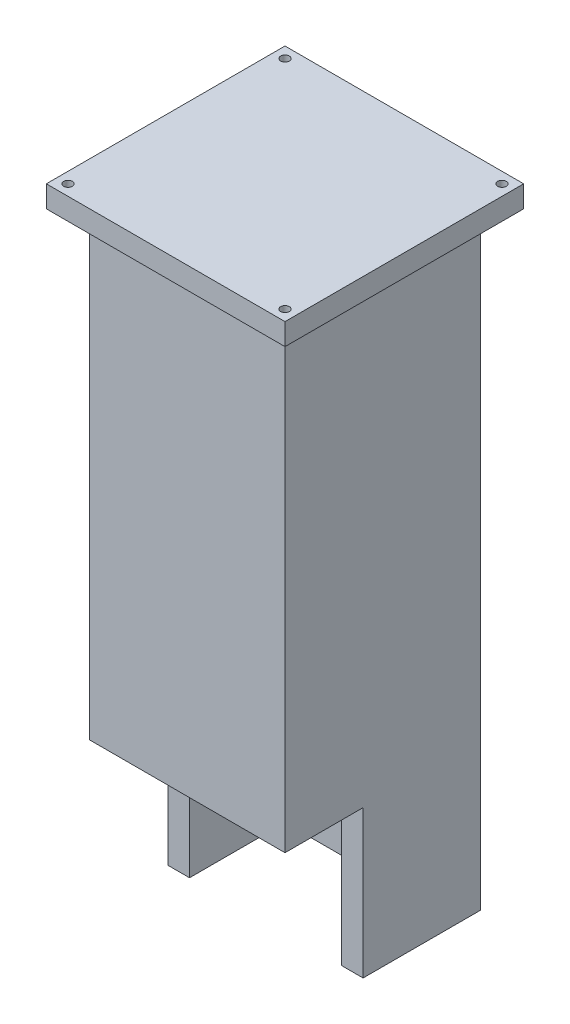
ISO-10303-21;
HEADER;
FILE_DESCRIPTION(('STEP AP214'),'2;1');
FILE_NAME('part.step','',(''),(''),'','','');
FILE_SCHEMA(('AUTOMOTIVE_DESIGN { 1 0 10303 214 1 1 1 1 }'));
ENDSEC;
DATA;
#1=APPLICATION_CONTEXT('core data for automotive mechanical design processes');
#2=APPLICATION_PROTOCOL_DEFINITION('international standard','automotive_design',2000,#1);
#3=PRODUCT_CONTEXT('',#1,'mechanical');
#4=PRODUCT('Part','Part','',(#3));
#5=PRODUCT_RELATED_PRODUCT_CATEGORY('part','',(#4));
#6=PRODUCT_DEFINITION_FORMATION('','',#4);
#7=PRODUCT_DEFINITION_CONTEXT('part definition',#1,'design');
#8=PRODUCT_DEFINITION('design','',#6,#7);
#9=PRODUCT_DEFINITION_SHAPE('','',#8);
#10=(LENGTH_UNIT() NAMED_UNIT(*) SI_UNIT(.MILLI.,.METRE.));
#11=(NAMED_UNIT(*) PLANE_ANGLE_UNIT() SI_UNIT($,.RADIAN.));
#12=(NAMED_UNIT(*) SI_UNIT($,.STERADIAN.) SOLID_ANGLE_UNIT());
#13=UNCERTAINTY_MEASURE_WITH_UNIT(LENGTH_MEASURE(1.E-05),#10,'distance_accuracy_value','');
#14=(GEOMETRIC_REPRESENTATION_CONTEXT(3) GLOBAL_UNCERTAINTY_ASSIGNED_CONTEXT((#13)) GLOBAL_UNIT_ASSIGNED_CONTEXT((#10,
#11,#12)) REPRESENTATION_CONTEXT('',''));
#15=CARTESIAN_POINT('',(0.,0.,0.));
#16=DIRECTION('',(0.,0.,1.));
#17=DIRECTION('',(1.,0.,0.));
#18=AXIS2_PLACEMENT_3D('',#15,#16,#17);
#19=CARTESIAN_POINT('',(0.,0.,0.));
#20=DIRECTION('',(0.,-1.,0.));
#21=DIRECTION('',(0.,0.,-1.));
#22=AXIS2_PLACEMENT_3D('',#19,#20,#21);
#23=PLANE('',#22);
#24=DIRECTION('',(1.,0.,0.));
#25=VECTOR('',#24,1.);
#26=CARTESIAN_POINT('',(-17.5,0.,-17.5));
#27=LINE('',#26,#25);
#28=CARTESIAN_POINT('',(-17.5,0.,-17.5));
#29=VERTEX_POINT('',#28);
#30=CARTESIAN_POINT('',(17.5,0.,-17.5));
#31=VERTEX_POINT('',#30);
#32=EDGE_CURVE('E201',#29,#31,#27,.T.);
#33=ORIENTED_EDGE('',*,*,#32,.F.);
#34=DIRECTION('',(0.,0.,-1.));
#35=VECTOR('',#34,1.);
#36=CARTESIAN_POINT('',(-17.5,0.,17.5));
#37=LINE('',#36,#35);
#38=CARTESIAN_POINT('',(-17.5,0.,4.5));
#39=VERTEX_POINT('',#38);
#40=EDGE_CURVE('E199',#39,#29,#37,.T.);
#41=ORIENTED_EDGE('',*,*,#40,.F.);
#42=DIRECTION('',(-1.,0.,0.));
#43=VECTOR('',#42,1.);
#44=CARTESIAN_POINT('',(22.5,0.,4.5));
#45=LINE('',#44,#43);
#46=CARTESIAN_POINT('',(-22.5,0.,4.50000000000001));
#47=VERTEX_POINT('',#46);
#48=EDGE_CURVE('E238',#39,#47,#45,.T.);
#49=ORIENTED_EDGE('',*,*,#48,.T.);
#50=DIRECTION('',(0.,0.,1.));
#51=VECTOR('',#50,1.);
#52=CARTESIAN_POINT('',(-22.5,0.,22.5));
#53=LINE('',#52,#51);
#54=CARTESIAN_POINT('',(-22.5,0.,-22.5));
#55=VERTEX_POINT('',#54);
#56=EDGE_CURVE('E250',#55,#47,#53,.T.);
#57=ORIENTED_EDGE('',*,*,#56,.F.);
#58=DIRECTION('',(-1.,0.,0.));
#59=VECTOR('',#58,1.);
#60=CARTESIAN_POINT('',(-22.5,0.,-22.5));
#61=LINE('',#60,#59);
#62=CARTESIAN_POINT('',(22.5,0.,-22.5));
#63=VERTEX_POINT('',#62);
#64=EDGE_CURVE('E247',#63,#55,#61,.T.);
#65=ORIENTED_EDGE('',*,*,#64,.F.);
#66=DIRECTION('',(0.,0.,-1.));
#67=VECTOR('',#66,1.);
#68=CARTESIAN_POINT('',(22.5,0.,22.5));
#69=LINE('',#68,#67);
#70=CARTESIAN_POINT('',(22.5,0.,4.5));
#71=VERTEX_POINT('',#70);
#72=EDGE_CURVE('E237',#71,#63,#69,.T.);
#73=ORIENTED_EDGE('',*,*,#72,.F.);
#74=CARTESIAN_POINT('',(17.5,0.,4.5));
#75=VERTEX_POINT('',#74);
#76=EDGE_CURVE('E234',#71,#75,#45,.T.);
#77=ORIENTED_EDGE('',*,*,#76,.T.);
#78=DIRECTION('',(0.,0.,-1.));
#79=VECTOR('',#78,1.);
#80=CARTESIAN_POINT('',(17.5,0.,17.5));
#81=LINE('',#80,#79);
#82=EDGE_CURVE('E203',#75,#31,#81,.T.);
#83=ORIENTED_EDGE('',*,*,#82,.T.);
#84=EDGE_LOOP('',(#33,#41,#49,#57,#65,#73,#77,#83));
#85=FACE_BOUND('',#84,.T.);
#86=ADVANCED_FACE('F38',(#85),#23,.T.);
#87=CARTESIAN_POINT('',(22.5,0.,4.5));
#88=DIRECTION('',(0.,0.,-1.));
#89=DIRECTION('',(-1.,0.,0.));
#90=AXIS2_PLACEMENT_3D('',#87,#88,#89);
#91=PLANE('',#90);
#92=DIRECTION('',(0.,-1.,0.));
#93=VECTOR('',#92,1.);
#94=CARTESIAN_POINT('',(-17.5,0.,4.5));
#95=LINE('',#94,#93);
#96=CARTESIAN_POINT('',(-17.5,34.,4.5));
#97=VERTEX_POINT('',#96);
#98=EDGE_CURVE('E219',#97,#39,#95,.T.);
#99=ORIENTED_EDGE('',*,*,#98,.F.);
#100=DIRECTION('',(-1.,0.,0.));
#101=VECTOR('',#100,1.);
#102=CARTESIAN_POINT('',(22.5,34.,4.5));
#103=LINE('',#102,#101);
#104=CARTESIAN_POINT('',(-22.5,34.,4.5));
#105=VERTEX_POINT('',#104);
#106=EDGE_CURVE('E242',#97,#105,#103,.T.);
#107=ORIENTED_EDGE('',*,*,#106,.T.);
#108=DIRECTION('',(0.,-1.,0.));
#109=VECTOR('',#108,1.);
#110=CARTESIAN_POINT('',(-22.5,0.,4.5));
#111=LINE('',#110,#109);
#112=EDGE_CURVE('E226',#105,#47,#111,.T.);
#113=ORIENTED_EDGE('',*,*,#112,.T.);
#114=ORIENTED_EDGE('',*,*,#48,.F.);
#115=EDGE_LOOP('',(#99,#107,#113,#114));
#116=FACE_BOUND('',#115,.T.);
#117=ADVANCED_FACE('F277',(#116),#91,.F.);
#118=CARTESIAN_POINT('',(22.5,34.,4.5));
#119=DIRECTION('',(0.,1.,0.));
#120=DIRECTION('',(0.,0.,1.));
#121=AXIS2_PLACEMENT_3D('',#118,#119,#120);
#122=PLANE('',#121);
#123=DIRECTION('',(0.,0.,-1.));
#124=VECTOR('',#123,1.);
#125=CARTESIAN_POINT('',(-17.5,34.,4.5));
#126=LINE('',#125,#124);
#127=CARTESIAN_POINT('',(-17.5,34.,17.5));
#128=VERTEX_POINT('',#127);
#129=EDGE_CURVE('E46',#128,#97,#126,.T.);
#130=ORIENTED_EDGE('',*,*,#129,.F.);
#131=DIRECTION('',(1.,0.,0.));
#132=VECTOR('',#131,1.);
#133=CARTESIAN_POINT('',(22.5,34.,17.5));
#134=LINE('',#133,#132);
#135=CARTESIAN_POINT('',(17.5,34.,17.5));
#136=VERTEX_POINT('',#135);
#137=EDGE_CURVE('E261',#128,#136,#134,.T.);
#138=ORIENTED_EDGE('',*,*,#137,.T.);
#139=DIRECTION('',(0.,0.,-1.));
#140=VECTOR('',#139,1.);
#141=CARTESIAN_POINT('',(17.5,34.,4.5));
#142=LINE('',#141,#140);
#143=CARTESIAN_POINT('',(17.5,34.,4.5));
#144=VERTEX_POINT('',#143);
#145=EDGE_CURVE('E264',#136,#144,#142,.T.);
#146=ORIENTED_EDGE('',*,*,#145,.T.);
#147=CARTESIAN_POINT('',(22.5,34.,4.5));
#148=VERTEX_POINT('',#147);
#149=EDGE_CURVE('E239',#148,#144,#103,.T.);
#150=ORIENTED_EDGE('',*,*,#149,.F.);
#151=DIRECTION('',(0.,0.,-1.));
#152=VECTOR('',#151,1.);
#153=CARTESIAN_POINT('',(22.5,34.,4.5));
#154=LINE('',#153,#152);
#155=CARTESIAN_POINT('',(22.5,34.,22.5));
#156=VERTEX_POINT('',#155);
#157=EDGE_CURVE('E222',#156,#148,#154,.T.);
#158=ORIENTED_EDGE('',*,*,#157,.F.);
#159=DIRECTION('',(-1.,0.,0.));
#160=VECTOR('',#159,1.);
#161=CARTESIAN_POINT('',(22.5,34.,22.5));
#162=LINE('',#161,#160);
#163=CARTESIAN_POINT('',(-22.5,34.,22.5));
#164=VERTEX_POINT('',#163);
#165=EDGE_CURVE('E229',#156,#164,#162,.T.);
#166=ORIENTED_EDGE('',*,*,#165,.T.);
#167=DIRECTION('',(0.,0.,-1.));
#168=VECTOR('',#167,1.);
#169=CARTESIAN_POINT('',(-22.5,34.,4.5));
#170=LINE('',#169,#168);
#171=EDGE_CURVE('E221',#164,#105,#170,.T.);
#172=ORIENTED_EDGE('',*,*,#171,.T.);
#173=ORIENTED_EDGE('',*,*,#106,.F.);
#174=EDGE_LOOP('',(#130,#138,#146,#150,#158,#166,#172,#173));
#175=FACE_BOUND('',#174,.T.);
#176=ADVANCED_FACE('F278',(#175),#122,.F.);
#177=CARTESIAN_POINT('',(22.5,300.,22.5));
#178=DIRECTION('',(-1.,0.,0.));
#179=DIRECTION('',(0.,0.,1.));
#180=AXIS2_PLACEMENT_3D('',#177,#178,#179);
#181=PLANE('',#180);
#182=DIRECTION('',(0.,-1.,0.));
#183=VECTOR('',#182,1.);
#184=CARTESIAN_POINT('',(22.5,300.,-22.5));
#185=LINE('',#184,#183);
#186=CARTESIAN_POINT('',(22.5,139.999999998358,-22.5));
#187=VERTEX_POINT('',#186);
#188=EDGE_CURVE('E259',#187,#63,#185,.T.);
#189=ORIENTED_EDGE('',*,*,#188,.F.);
#190=DIRECTION('',(0.,0.,-1.));
#191=VECTOR('',#190,1.);
#192=CARTESIAN_POINT('',(22.5,139.999999998358,22.5));
#193=LINE('',#192,#191);
#194=CARTESIAN_POINT('',(22.5,139.999999998358,22.5));
#195=VERTEX_POINT('',#194);
#196=EDGE_CURVE('E178',#195,#187,#193,.T.);
#197=ORIENTED_EDGE('',*,*,#196,.F.);
#198=DIRECTION('',(0.,-1.,0.));
#199=VECTOR('',#198,1.);
#200=CARTESIAN_POINT('',(22.5,300.,22.5));
#201=LINE('',#200,#199);
#202=EDGE_CURVE('E253',#195,#156,#201,.T.);
#203=ORIENTED_EDGE('',*,*,#202,.T.);
#204=ORIENTED_EDGE('',*,*,#157,.T.);
#205=DIRECTION('',(0.,-1.,0.));
#206=VECTOR('',#205,1.);
#207=CARTESIAN_POINT('',(22.5,0.,4.5));
#208=LINE('',#207,#206);
#209=EDGE_CURVE('E225',#148,#71,#208,.T.);
#210=ORIENTED_EDGE('',*,*,#209,.T.);
#211=ORIENTED_EDGE('',*,*,#72,.T.);
#212=EDGE_LOOP('',(#189,#197,#203,#204,#210,#211));
#213=FACE_BOUND('',#212,.T.);
#214=ADVANCED_FACE('F40',(#213),#181,.F.);
#215=CARTESIAN_POINT('',(-22.5,300.,-22.5));
#216=DIRECTION('',(0.,0.,1.));
#217=DIRECTION('',(1.,0.,0.));
#218=AXIS2_PLACEMENT_3D('',#215,#216,#217);
#219=PLANE('',#218);
#220=DIRECTION('',(0.,-1.,0.));
#221=VECTOR('',#220,1.);
#222=CARTESIAN_POINT('',(-22.5,300.,-22.5));
#223=LINE('',#222,#221);
#224=CARTESIAN_POINT('',(-22.5,139.999999998358,-22.5));
#225=VERTEX_POINT('',#224);
#226=EDGE_CURVE('E257',#225,#55,#223,.T.);
#227=ORIENTED_EDGE('',*,*,#226,.F.);
#228=DIRECTION('',(1.,0.,0.));
#229=VECTOR('',#228,1.);
#230=CARTESIAN_POINT('',(-22.5,139.999999998358,-22.5));
#231=LINE('',#230,#229);
#232=EDGE_CURVE('E188',#225,#187,#231,.T.);
#233=ORIENTED_EDGE('',*,*,#232,.T.);
#234=ORIENTED_EDGE('',*,*,#188,.T.);
#235=ORIENTED_EDGE('',*,*,#64,.T.);
#236=EDGE_LOOP('',(#227,#233,#234,#235));
#237=FACE_BOUND('',#236,.T.);
#238=ADVANCED_FACE('F323',(#237),#219,.F.);
#239=CARTESIAN_POINT('',(-22.5,300.,22.5));
#240=DIRECTION('',(1.,0.,0.));
#241=DIRECTION('',(0.,0.,-1.));
#242=AXIS2_PLACEMENT_3D('',#239,#240,#241);
#243=PLANE('',#242);
#244=DIRECTION('',(0.,-1.,0.));
#245=VECTOR('',#244,1.);
#246=CARTESIAN_POINT('',(-22.5,300.,22.5));
#247=LINE('',#246,#245);
#248=CARTESIAN_POINT('',(-22.5,139.999999998358,22.5));
#249=VERTEX_POINT('',#248);
#250=EDGE_CURVE('E255',#249,#164,#247,.T.);
#251=ORIENTED_EDGE('',*,*,#250,.F.);
#252=DIRECTION('',(0.,0.,-1.));
#253=VECTOR('',#252,1.);
#254=CARTESIAN_POINT('',(-22.5,139.999999998358,22.5));
#255=LINE('',#254,#253);
#256=EDGE_CURVE('E181',#249,#225,#255,.T.);
#257=ORIENTED_EDGE('',*,*,#256,.T.);
#258=ORIENTED_EDGE('',*,*,#226,.T.);
#259=ORIENTED_EDGE('',*,*,#56,.T.);
#260=ORIENTED_EDGE('',*,*,#112,.F.);
#261=ORIENTED_EDGE('',*,*,#171,.F.);
#262=EDGE_LOOP('',(#251,#257,#258,#259,#260,#261));
#263=FACE_BOUND('',#262,.T.);
#264=ADVANCED_FACE('F284',(#263),#243,.F.);
#265=CARTESIAN_POINT('',(-22.5,300.,22.5));
#266=DIRECTION('',(0.,0.,-1.));
#267=DIRECTION('',(-1.,0.,0.));
#268=AXIS2_PLACEMENT_3D('',#265,#266,#267);
#269=PLANE('',#268);
#270=ORIENTED_EDGE('',*,*,#202,.F.);
#271=DIRECTION('',(1.,0.,0.));
#272=VECTOR('',#271,1.);
#273=CARTESIAN_POINT('',(-22.5,139.999999998358,22.5));
#274=LINE('',#273,#272);
#275=EDGE_CURVE('E53',#249,#195,#274,.T.);
#276=ORIENTED_EDGE('',*,*,#275,.F.);
#277=ORIENTED_EDGE('',*,*,#250,.T.);
#278=ORIENTED_EDGE('',*,*,#165,.F.);
#279=EDGE_LOOP('',(#270,#276,#277,#278));
#280=FACE_BOUND('',#279,.T.);
#281=ADVANCED_FACE('F319',(#280),#269,.F.);
#282=ORIENTED_EDGE('',*,*,#149,.T.);
#283=DIRECTION('',(0.,-1.,0.));
#284=VECTOR('',#283,1.);
#285=CARTESIAN_POINT('',(17.5,0.,4.5));
#286=LINE('',#285,#284);
#287=EDGE_CURVE('E216',#144,#75,#286,.T.);
#288=ORIENTED_EDGE('',*,*,#287,.T.);
#289=ORIENTED_EDGE('',*,*,#76,.F.);
#290=ORIENTED_EDGE('',*,*,#209,.F.);
#291=EDGE_LOOP('',(#282,#288,#289,#290));
#292=FACE_BOUND('',#291,.T.);
#293=ADVANCED_FACE('F316',(#292),#91,.F.);
#294=CARTESIAN_POINT('',(-17.5,0.,17.5));
#295=DIRECTION('',(1.,0.,0.));
#296=DIRECTION('',(0.,0.,-1.));
#297=AXIS2_PLACEMENT_3D('',#294,#295,#296);
#298=PLANE('',#297);
#299=DIRECTION('',(0.,0.,-1.));
#300=VECTOR('',#299,1.);
#301=CARTESIAN_POINT('',(-17.5,139.999999998358,17.5));
#302=LINE('',#301,#300);
#303=CARTESIAN_POINT('',(-17.5,139.999999998358,17.5));
#304=VERTEX_POINT('',#303);
#305=CARTESIAN_POINT('',(-17.5,139.999999998358,-17.5));
#306=VERTEX_POINT('',#305);
#307=EDGE_CURVE('E195',#304,#306,#302,.T.);
#308=ORIENTED_EDGE('',*,*,#307,.F.);
#309=DIRECTION('',(0.,1.,0.));
#310=VECTOR('',#309,1.);
#311=CARTESIAN_POINT('',(-17.5,0.,17.5));
#312=LINE('',#311,#310);
#313=EDGE_CURVE('E206',#128,#304,#312,.T.);
#314=ORIENTED_EDGE('',*,*,#313,.F.);
#315=ORIENTED_EDGE('',*,*,#129,.T.);
#316=ORIENTED_EDGE('',*,*,#98,.T.);
#317=ORIENTED_EDGE('',*,*,#40,.T.);
#318=DIRECTION('',(0.,1.,0.));
#319=VECTOR('',#318,1.);
#320=CARTESIAN_POINT('',(-17.5,0.,-17.5));
#321=LINE('',#320,#319);
#322=EDGE_CURVE('E213',#29,#306,#321,.T.);
#323=ORIENTED_EDGE('',*,*,#322,.T.);
#324=EDGE_LOOP('',(#308,#314,#315,#316,#317,#323));
#325=FACE_BOUND('',#324,.T.);
#326=ADVANCED_FACE('F271',(#325),#298,.T.);
#327=CARTESIAN_POINT('',(17.5,0.,17.5));
#328=DIRECTION('',(1.,0.,0.));
#329=DIRECTION('',(0.,0.,-1.));
#330=AXIS2_PLACEMENT_3D('',#327,#328,#329);
#331=PLANE('',#330);
#332=DIRECTION('',(0.,1.,0.));
#333=VECTOR('',#332,1.);
#334=CARTESIAN_POINT('',(17.5,0.,17.5));
#335=LINE('',#334,#333);
#336=CARTESIAN_POINT('',(17.5,139.999999998358,17.5));
#337=VERTEX_POINT('',#336);
#338=EDGE_CURVE('E61',#136,#337,#335,.T.);
#339=ORIENTED_EDGE('',*,*,#338,.T.);
#340=DIRECTION('',(0.,0.,-1.));
#341=VECTOR('',#340,1.);
#342=CARTESIAN_POINT('',(17.5,139.999999998358,17.5));
#343=LINE('',#342,#341);
#344=CARTESIAN_POINT('',(17.5,139.999999998358,-17.5));
#345=VERTEX_POINT('',#344);
#346=EDGE_CURVE('E191',#337,#345,#343,.T.);
#347=ORIENTED_EDGE('',*,*,#346,.T.);
#348=DIRECTION('',(0.,1.,0.));
#349=VECTOR('',#348,1.);
#350=CARTESIAN_POINT('',(17.5,0.,-17.5));
#351=LINE('',#350,#349);
#352=EDGE_CURVE('E210',#31,#345,#351,.T.);
#353=ORIENTED_EDGE('',*,*,#352,.F.);
#354=ORIENTED_EDGE('',*,*,#82,.F.);
#355=ORIENTED_EDGE('',*,*,#287,.F.);
#356=ORIENTED_EDGE('',*,*,#145,.F.);
#357=EDGE_LOOP('',(#339,#347,#353,#354,#355,#356));
#358=FACE_BOUND('',#357,.T.);
#359=ADVANCED_FACE('F299',(#358),#331,.F.);
#360=CARTESIAN_POINT('',(-17.5,0.,17.5));
#361=DIRECTION('',(0.,0.,1.));
#362=DIRECTION('',(1.,0.,0.));
#363=AXIS2_PLACEMENT_3D('',#360,#361,#362);
#364=PLANE('',#363);
#365=ORIENTED_EDGE('',*,*,#313,.T.);
#366=DIRECTION('',(1.,0.,0.));
#367=VECTOR('',#366,1.);
#368=CARTESIAN_POINT('',(-17.5,139.999999998358,17.5));
#369=LINE('',#368,#367);
#370=EDGE_CURVE('E197',#304,#337,#369,.T.);
#371=ORIENTED_EDGE('',*,*,#370,.T.);
#372=ORIENTED_EDGE('',*,*,#338,.F.);
#373=ORIENTED_EDGE('',*,*,#137,.F.);
#374=EDGE_LOOP('',(#365,#371,#372,#373));
#375=FACE_BOUND('',#374,.T.);
#376=ADVANCED_FACE('F300',(#375),#364,.F.);
#377=CARTESIAN_POINT('',(-17.5,0.,-17.5));
#378=DIRECTION('',(0.,0.,1.));
#379=DIRECTION('',(1.,0.,0.));
#380=AXIS2_PLACEMENT_3D('',#377,#378,#379);
#381=PLANE('',#380);
#382=DIRECTION('',(1.,0.,0.));
#383=VECTOR('',#382,1.);
#384=CARTESIAN_POINT('',(-17.5,139.999999998358,-17.5));
#385=LINE('',#384,#383);
#386=EDGE_CURVE('E11',#306,#345,#385,.T.);
#387=ORIENTED_EDGE('',*,*,#386,.F.);
#388=ORIENTED_EDGE('',*,*,#322,.F.);
#389=ORIENTED_EDGE('',*,*,#32,.T.);
#390=ORIENTED_EDGE('',*,*,#352,.T.);
#391=EDGE_LOOP('',(#387,#388,#389,#390));
#392=FACE_BOUND('',#391,.T.);
#393=ADVANCED_FACE('F294',(#392),#381,.T.);
#394=CARTESIAN_POINT('',(0.,139.999999998358,0.));
#395=DIRECTION('',(0.,-1.,0.));
#396=DIRECTION('',(0.,0.,-1.));
#397=AXIS2_PLACEMENT_3D('',#394,#395,#396);
#398=PLANE('',#397);
#399=ORIENTED_EDGE('',*,*,#370,.F.);
#400=ORIENTED_EDGE('',*,*,#307,.T.);
#401=ORIENTED_EDGE('',*,*,#386,.T.);
#402=ORIENTED_EDGE('',*,*,#346,.F.);
#403=EDGE_LOOP('',(#399,#400,#401,#402));
#404=FACE_BOUND('',#403,.T.);
#405=ADVANCED_FACE('F297',(#404),#398,.T.);
#406=CARTESIAN_POINT('',(25.,139.999999998358,-25.));
#407=DIRECTION('',(0.,1.,0.));
#408=DIRECTION('',(0.,0.,1.));
#409=AXIS2_PLACEMENT_3D('',#406,#407,#408);
#410=CIRCLE('',#409,1.);
#411=CARTESIAN_POINT('',(25.,139.999999998358,-24.));
#412=VERTEX_POINT('',#411);
#413=EDGE_CURVE('E566',#412,#412,#410,.T.);
#414=ORIENTED_EDGE('',*,*,#413,.T.);
#415=EDGE_LOOP('',(#414));
#416=FACE_BOUND('',#415,.T.);
#417=CARTESIAN_POINT('',(-25.,139.999999998358,-25.));
#418=DIRECTION('',(0.,1.,0.));
#419=DIRECTION('',(0.,0.,1.));
#420=AXIS2_PLACEMENT_3D('',#417,#418,#419);
#421=CIRCLE('',#420,1.);
#422=CARTESIAN_POINT('',(-25.,139.999999998358,-24.));
#423=VERTEX_POINT('',#422);
#424=EDGE_CURVE('E578',#423,#423,#421,.T.);
#425=ORIENTED_EDGE('',*,*,#424,.T.);
#426=EDGE_LOOP('',(#425));
#427=FACE_BOUND('',#426,.T.);
#428=DIRECTION('',(0.,0.,-1.));
#429=VECTOR('',#428,1.);
#430=CARTESIAN_POINT('',(27.5,139.999999998358,27.5));
#431=LINE('',#430,#429);
#432=CARTESIAN_POINT('',(27.5,139.999999998358,27.5));
#433=VERTEX_POINT('',#432);
#434=CARTESIAN_POINT('',(27.5,139.999999998358,-27.5));
#435=VERTEX_POINT('',#434);
#436=EDGE_CURVE('E177',#433,#435,#431,.T.);
#437=ORIENTED_EDGE('',*,*,#436,.F.);
#438=DIRECTION('',(1.,0.,0.));
#439=VECTOR('',#438,1.);
#440=CARTESIAN_POINT('',(-27.5,139.999999998358,27.5));
#441=LINE('',#440,#439);
#442=CARTESIAN_POINT('',(-27.5,139.999999998358,27.5));
#443=VERTEX_POINT('',#442);
#444=EDGE_CURVE('E173',#443,#433,#441,.T.);
#445=ORIENTED_EDGE('',*,*,#444,.F.);
#446=DIRECTION('',(0.,0.,1.));
#447=VECTOR('',#446,1.);
#448=CARTESIAN_POINT('',(-27.5,139.999999998358,27.5));
#449=LINE('',#448,#447);
#450=CARTESIAN_POINT('',(-27.5,139.999999998358,-27.5));
#451=VERTEX_POINT('',#450);
#452=EDGE_CURVE('E592',#451,#443,#449,.T.);
#453=ORIENTED_EDGE('',*,*,#452,.F.);
#454=DIRECTION('',(-1.,0.,0.));
#455=VECTOR('',#454,1.);
#456=CARTESIAN_POINT('',(-27.5,139.999999998358,-27.5));
#457=LINE('',#456,#455);
#458=EDGE_CURVE('E590',#435,#451,#457,.T.);
#459=ORIENTED_EDGE('',*,*,#458,.F.);
#460=EDGE_LOOP('',(#437,#445,#453,#459));
#461=FACE_BOUND('',#460,.T.);
#462=CARTESIAN_POINT('',(25.,139.999999998358,25.));
#463=DIRECTION('',(0.,1.,0.));
#464=DIRECTION('',(0.,0.,1.));
#465=AXIS2_PLACEMENT_3D('',#462,#463,#464);
#466=CIRCLE('',#465,1.);
#467=CARTESIAN_POINT('',(25.,139.999999998358,26.));
#468=VERTEX_POINT('',#467);
#469=EDGE_CURVE('E572',#468,#468,#466,.T.);
#470=ORIENTED_EDGE('',*,*,#469,.T.);
#471=EDGE_LOOP('',(#470));
#472=FACE_BOUND('',#471,.T.);
#473=CARTESIAN_POINT('',(-25.,139.999999998358,25.));
#474=DIRECTION('',(0.,1.,0.));
#475=DIRECTION('',(0.,0.,1.));
#476=AXIS2_PLACEMENT_3D('',#473,#474,#475);
#477=CIRCLE('',#476,1.);
#478=CARTESIAN_POINT('',(-25.,139.999999998358,26.));
#479=VERTEX_POINT('',#478);
#480=EDGE_CURVE('E563',#479,#479,#477,.T.);
#481=ORIENTED_EDGE('',*,*,#480,.T.);
#482=EDGE_LOOP('',(#481));
#483=FACE_BOUND('',#482,.T.);
#484=ORIENTED_EDGE('',*,*,#232,.F.);
#485=ORIENTED_EDGE('',*,*,#256,.F.);
#486=ORIENTED_EDGE('',*,*,#275,.T.);
#487=ORIENTED_EDGE('',*,*,#196,.T.);
#488=EDGE_LOOP('',(#484,#485,#486,#487));
#489=FACE_BOUND('',#488,.T.);
#490=ADVANCED_FACE('F333',(#416,#427,#461,#472,#483,#489),#398,.T.);
#491=CARTESIAN_POINT('',(0.,144.999999998358,0.));
#492=DIRECTION('',(0.,-1.,0.));
#493=DIRECTION('',(0.,0.,-1.));
#494=AXIS2_PLACEMENT_3D('',#491,#492,#493);
#495=PLANE('',#494);
#496=DIRECTION('',(0.,0.,-1.));
#497=VECTOR('',#496,1.);
#498=CARTESIAN_POINT('',(27.5,144.999999998358,27.5));
#499=LINE('',#498,#497);
#500=CARTESIAN_POINT('',(27.5,144.999999998358,27.5));
#501=VERTEX_POINT('',#500);
#502=CARTESIAN_POINT('',(27.5,144.999999998358,-27.5));
#503=VERTEX_POINT('',#502);
#504=EDGE_CURVE('E163',#501,#503,#499,.T.);
#505=ORIENTED_EDGE('',*,*,#504,.T.);
#506=DIRECTION('',(-1.,0.,0.));
#507=VECTOR('',#506,1.);
#508=CARTESIAN_POINT('',(-27.5,144.999999998358,-27.5));
#509=LINE('',#508,#507);
#510=CARTESIAN_POINT('',(-27.5,144.999999998358,-27.5));
#511=VERTEX_POINT('',#510);
#512=EDGE_CURVE('E152',#503,#511,#509,.T.);
#513=ORIENTED_EDGE('',*,*,#512,.T.);
#514=DIRECTION('',(0.,0.,1.));
#515=VECTOR('',#514,1.);
#516=CARTESIAN_POINT('',(-27.5,144.999999998358,27.5));
#517=LINE('',#516,#515);
#518=CARTESIAN_POINT('',(-27.5,144.999999998358,27.5));
#519=VERTEX_POINT('',#518);
#520=EDGE_CURVE('E162',#511,#519,#517,.T.);
#521=ORIENTED_EDGE('',*,*,#520,.T.);
#522=DIRECTION('',(1.,0.,0.));
#523=VECTOR('',#522,1.);
#524=CARTESIAN_POINT('',(-27.5,144.999999998358,27.5));
#525=LINE('',#524,#523);
#526=EDGE_CURVE('E169',#519,#501,#525,.T.);
#527=ORIENTED_EDGE('',*,*,#526,.T.);
#528=EDGE_LOOP('',(#505,#513,#521,#527));
#529=FACE_BOUND('',#528,.T.);
#530=CARTESIAN_POINT('',(-25.,144.999999998358,-25.));
#531=DIRECTION('',(0.,1.,0.));
#532=DIRECTION('',(0.,0.,1.));
#533=AXIS2_PLACEMENT_3D('',#530,#531,#532);
#534=CIRCLE('',#533,1.);
#535=CARTESIAN_POINT('',(-25.,144.999999998358,-24.));
#536=VERTEX_POINT('',#535);
#537=EDGE_CURVE('E581',#536,#536,#534,.T.);
#538=ORIENTED_EDGE('',*,*,#537,.F.);
#539=EDGE_LOOP('',(#538));
#540=FACE_BOUND('',#539,.T.);
#541=CARTESIAN_POINT('',(25.,144.999999998358,25.));
#542=DIRECTION('',(0.,1.,0.));
#543=DIRECTION('',(0.,0.,1.));
#544=AXIS2_PLACEMENT_3D('',#541,#542,#543);
#545=CIRCLE('',#544,1.);
#546=CARTESIAN_POINT('',(25.,144.999999998358,26.));
#547=VERTEX_POINT('',#546);
#548=EDGE_CURVE('E575',#547,#547,#545,.T.);
#549=ORIENTED_EDGE('',*,*,#548,.F.);
#550=EDGE_LOOP('',(#549));
#551=FACE_BOUND('',#550,.T.);
#552=CARTESIAN_POINT('',(25.,144.999999998358,-25.));
#553=DIRECTION('',(0.,1.,0.));
#554=DIRECTION('',(0.,0.,1.));
#555=AXIS2_PLACEMENT_3D('',#552,#553,#554);
#556=CIRCLE('',#555,1.);
#557=CARTESIAN_POINT('',(25.,144.999999998358,-24.));
#558=VERTEX_POINT('',#557);
#559=EDGE_CURVE('E569',#558,#558,#556,.T.);
#560=ORIENTED_EDGE('',*,*,#559,.F.);
#561=EDGE_LOOP('',(#560));
#562=FACE_BOUND('',#561,.T.);
#563=CARTESIAN_POINT('',(-25.,144.999999998358,25.));
#564=DIRECTION('',(0.,1.,0.));
#565=DIRECTION('',(0.,0.,1.));
#566=AXIS2_PLACEMENT_3D('',#563,#564,#565);
#567=CIRCLE('',#566,1.);
#568=CARTESIAN_POINT('',(-25.,144.999999998358,26.));
#569=VERTEX_POINT('',#568);
#570=EDGE_CURVE('E560',#569,#569,#567,.T.);
#571=ORIENTED_EDGE('',*,*,#570,.F.);
#572=EDGE_LOOP('',(#571));
#573=FACE_BOUND('',#572,.T.);
#574=ADVANCED_FACE('F166',(#529,#540,#551,#562,#573),#495,.F.);
#575=CARTESIAN_POINT('',(27.5,144.999999998358,27.5));
#576=DIRECTION('',(-1.,0.,0.));
#577=DIRECTION('',(0.,0.,1.));
#578=AXIS2_PLACEMENT_3D('',#575,#576,#577);
#579=PLANE('',#578);
#580=ORIENTED_EDGE('',*,*,#436,.T.);
#581=DIRECTION('',(0.,-1.,0.));
#582=VECTOR('',#581,1.);
#583=CARTESIAN_POINT('',(27.5,144.999999998358,-27.5));
#584=LINE('',#583,#582);
#585=EDGE_CURVE('E156',#503,#435,#584,.T.);
#586=ORIENTED_EDGE('',*,*,#585,.F.);
#587=ORIENTED_EDGE('',*,*,#504,.F.);
#588=DIRECTION('',(0.,-1.,0.));
#589=VECTOR('',#588,1.);
#590=CARTESIAN_POINT('',(27.5,144.999999998358,27.5));
#591=LINE('',#590,#589);
#592=EDGE_CURVE('E588',#501,#433,#591,.T.);
#593=ORIENTED_EDGE('',*,*,#592,.T.);
#594=EDGE_LOOP('',(#580,#586,#587,#593));
#595=FACE_BOUND('',#594,.T.);
#596=ADVANCED_FACE('F175',(#595),#579,.F.);
#597=CARTESIAN_POINT('',(-27.5,144.999999998358,-27.5));
#598=DIRECTION('',(0.,0.,1.));
#599=DIRECTION('',(1.,0.,0.));
#600=AXIS2_PLACEMENT_3D('',#597,#598,#599);
#601=PLANE('',#600);
#602=ORIENTED_EDGE('',*,*,#458,.T.);
#603=DIRECTION('',(0.,-1.,0.));
#604=VECTOR('',#603,1.);
#605=CARTESIAN_POINT('',(-27.5,144.999999998358,-27.5));
#606=LINE('',#605,#604);
#607=EDGE_CURVE('E159',#511,#451,#606,.T.);
#608=ORIENTED_EDGE('',*,*,#607,.F.);
#609=ORIENTED_EDGE('',*,*,#512,.F.);
#610=ORIENTED_EDGE('',*,*,#585,.T.);
#611=EDGE_LOOP('',(#602,#608,#609,#610));
#612=FACE_BOUND('',#611,.T.);
#613=ADVANCED_FACE('F154',(#612),#601,.F.);
#614=CARTESIAN_POINT('',(-27.5,144.999999998358,27.5));
#615=DIRECTION('',(1.,0.,0.));
#616=DIRECTION('',(0.,0.,-1.));
#617=AXIS2_PLACEMENT_3D('',#614,#615,#616);
#618=PLANE('',#617);
#619=ORIENTED_EDGE('',*,*,#452,.T.);
#620=DIRECTION('',(0.,-1.,0.));
#621=VECTOR('',#620,1.);
#622=CARTESIAN_POINT('',(-27.5,144.999999998358,27.5));
#623=LINE('',#622,#621);
#624=EDGE_CURVE('E183',#519,#443,#623,.T.);
#625=ORIENTED_EDGE('',*,*,#624,.F.);
#626=ORIENTED_EDGE('',*,*,#520,.F.);
#627=ORIENTED_EDGE('',*,*,#607,.T.);
#628=EDGE_LOOP('',(#619,#625,#626,#627));
#629=FACE_BOUND('',#628,.T.);
#630=ADVANCED_FACE('F405',(#629),#618,.F.);
#631=CARTESIAN_POINT('',(-27.5,144.999999998358,27.5));
#632=DIRECTION('',(0.,0.,-1.));
#633=DIRECTION('',(-1.,0.,0.));
#634=AXIS2_PLACEMENT_3D('',#631,#632,#633);
#635=PLANE('',#634);
#636=ORIENTED_EDGE('',*,*,#444,.T.);
#637=ORIENTED_EDGE('',*,*,#592,.F.);
#638=ORIENTED_EDGE('',*,*,#526,.F.);
#639=ORIENTED_EDGE('',*,*,#624,.T.);
#640=EDGE_LOOP('',(#636,#637,#638,#639));
#641=FACE_BOUND('',#640,.T.);
#642=ADVANCED_FACE('F415',(#641),#635,.F.);
#643=CARTESIAN_POINT('',(-25.,144.999999998358,-25.));
#644=DIRECTION('',(0.,-1.,0.));
#645=DIRECTION('',(0.,0.,-1.));
#646=AXIS2_PLACEMENT_3D('',#643,#644,#645);
#647=CYLINDRICAL_SURFACE('',#646,1.);
#648=ORIENTED_EDGE('',*,*,#537,.T.);
#649=EDGE_LOOP('',(#648));
#650=FACE_BOUND('',#649,.T.);
#651=ORIENTED_EDGE('',*,*,#424,.F.);
#652=EDGE_LOOP('',(#651));
#653=FACE_BOUND('',#652,.T.);
#654=ADVANCED_FACE('F426',(#650,#653),#647,.F.);
#655=CARTESIAN_POINT('',(25.,144.999999998358,25.));
#656=DIRECTION('',(0.,-1.,0.));
#657=DIRECTION('',(0.,0.,-1.));
#658=AXIS2_PLACEMENT_3D('',#655,#656,#657);
#659=CYLINDRICAL_SURFACE('',#658,1.);
#660=ORIENTED_EDGE('',*,*,#548,.T.);
#661=EDGE_LOOP('',(#660));
#662=FACE_BOUND('',#661,.T.);
#663=ORIENTED_EDGE('',*,*,#469,.F.);
#664=EDGE_LOOP('',(#663));
#665=FACE_BOUND('',#664,.T.);
#666=ADVANCED_FACE('F437',(#662,#665),#659,.F.);
#667=CARTESIAN_POINT('',(25.,144.999999998358,-25.));
#668=DIRECTION('',(0.,-1.,0.));
#669=DIRECTION('',(0.,0.,-1.));
#670=AXIS2_PLACEMENT_3D('',#667,#668,#669);
#671=CYLINDRICAL_SURFACE('',#670,1.);
#672=ORIENTED_EDGE('',*,*,#559,.T.);
#673=EDGE_LOOP('',(#672));
#674=FACE_BOUND('',#673,.T.);
#675=ORIENTED_EDGE('',*,*,#413,.F.);
#676=EDGE_LOOP('',(#675));
#677=FACE_BOUND('',#676,.T.);
#678=ADVANCED_FACE('F448',(#674,#677),#671,.F.);
#679=CARTESIAN_POINT('',(-25.,144.999999998358,25.));
#680=DIRECTION('',(0.,-1.,0.));
#681=DIRECTION('',(0.,0.,-1.));
#682=AXIS2_PLACEMENT_3D('',#679,#680,#681);
#683=CYLINDRICAL_SURFACE('',#682,1.);
#684=ORIENTED_EDGE('',*,*,#570,.T.);
#685=EDGE_LOOP('',(#684));
#686=FACE_BOUND('',#685,.T.);
#687=ORIENTED_EDGE('',*,*,#480,.F.);
#688=EDGE_LOOP('',(#687));
#689=FACE_BOUND('',#688,.T.);
#690=ADVANCED_FACE('F459',(#686,#689),#683,.F.);
#691=CLOSED_SHELL('',(#86,#117,#176,#214,#238,#264,#281,#293,#326,#359,#376,#393,#405,#490,#574,
#596,#613,#630,#642,#654,#666,#678,#690));
#692=MANIFOLD_SOLID_BREP('B2',#691);
#693=ADVANCED_BREP_SHAPE_REPRESENTATION('',(#18,#692),#14);
#694=SHAPE_DEFINITION_REPRESENTATION(#9,#693);
ENDSEC;
END-ISO-10303-21;
